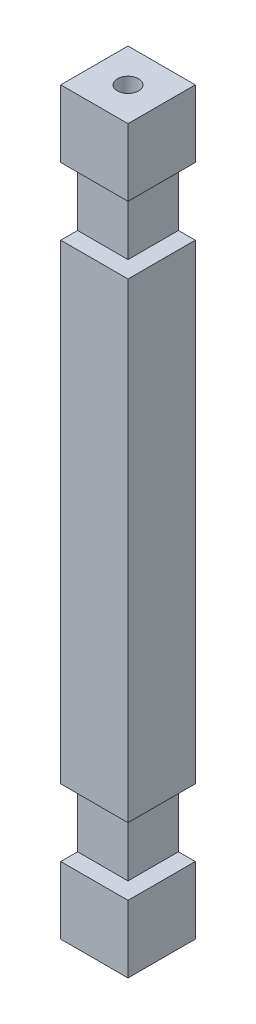
ISO-10303-21;
HEADER;
FILE_DESCRIPTION(('STEP AP214'),'2;1');
FILE_NAME('part.step','',(''),(''),'','','');
FILE_SCHEMA(('AUTOMOTIVE_DESIGN { 1 0 10303 214 1 1 1 1 }'));
ENDSEC;
DATA;
#1=APPLICATION_CONTEXT('core data for automotive mechanical design processes');
#2=APPLICATION_PROTOCOL_DEFINITION('international standard','automotive_design',2000,#1);
#3=PRODUCT_CONTEXT('',#1,'mechanical');
#4=PRODUCT('Part','Part','',(#3));
#5=PRODUCT_RELATED_PRODUCT_CATEGORY('part','',(#4));
#6=PRODUCT_DEFINITION_FORMATION('','',#4);
#7=PRODUCT_DEFINITION_CONTEXT('part definition',#1,'design');
#8=PRODUCT_DEFINITION('design','',#6,#7);
#9=PRODUCT_DEFINITION_SHAPE('','',#8);
#10=(LENGTH_UNIT() NAMED_UNIT(*) SI_UNIT(.MILLI.,.METRE.));
#11=(NAMED_UNIT(*) PLANE_ANGLE_UNIT() SI_UNIT($,.RADIAN.));
#12=(NAMED_UNIT(*) SI_UNIT($,.STERADIAN.) SOLID_ANGLE_UNIT());
#13=UNCERTAINTY_MEASURE_WITH_UNIT(LENGTH_MEASURE(1.E-05),#10,'distance_accuracy_value','');
#14=(GEOMETRIC_REPRESENTATION_CONTEXT(3) GLOBAL_UNCERTAINTY_ASSIGNED_CONTEXT((#13)) GLOBAL_UNIT_ASSIGNED_CONTEXT((#10,
#11,#12)) REPRESENTATION_CONTEXT('',''));
#15=CARTESIAN_POINT('',(0.,0.,0.));
#16=DIRECTION('',(0.,0.,1.));
#17=DIRECTION('',(1.,0.,0.));
#18=AXIS2_PLACEMENT_3D('',#15,#16,#17);
#19=CARTESIAN_POINT('',(25.4,279.4,50.8));
#20=DIRECTION('',(-1.,0.,0.));
#21=DIRECTION('',(0.,-1.,0.));
#22=AXIS2_PLACEMENT_3D('',#19,#20,#21);
#23=PLANE('',#22);
#24=DIRECTION('',(0.,0.,1.));
#25=VECTOR('',#24,1.);
#26=CARTESIAN_POINT('',(25.4000000000001,-177.8,38.1));
#27=LINE('',#26,#25);
#28=CARTESIAN_POINT('',(25.4000000000001,-177.8,0.));
#29=VERTEX_POINT('',#28);
#30=CARTESIAN_POINT('',(25.4,-177.8,50.8));
#31=VERTEX_POINT('',#30);
#32=EDGE_CURVE('E62',#29,#31,#27,.T.);
#33=ORIENTED_EDGE('',*,*,#32,.F.);
#34=DIRECTION('',(0.,1.,0.));
#35=VECTOR('',#34,1.);
#36=CARTESIAN_POINT('',(25.4,279.4,0.));
#37=LINE('',#36,#35);
#38=CARTESIAN_POINT('',(25.4,177.8,0.));
#39=VERTEX_POINT('',#38);
#40=EDGE_CURVE('E289',#29,#39,#37,.T.);
#41=ORIENTED_EDGE('',*,*,#40,.T.);
#42=DIRECTION('',(0.,0.,1.));
#43=VECTOR('',#42,1.);
#44=CARTESIAN_POINT('',(25.4000000000001,177.8,38.1));
#45=LINE('',#44,#43);
#46=CARTESIAN_POINT('',(25.4000000000001,177.8,50.8));
#47=VERTEX_POINT('',#46);
#48=EDGE_CURVE('E253',#39,#47,#45,.T.);
#49=ORIENTED_EDGE('',*,*,#48,.T.);
#50=DIRECTION('',(0.,1.,0.));
#51=VECTOR('',#50,1.);
#52=CARTESIAN_POINT('',(25.4,279.4,50.8));
#53=LINE('',#52,#51);
#54=EDGE_CURVE('E274',#31,#47,#53,.T.);
#55=ORIENTED_EDGE('',*,*,#54,.F.);
#56=EDGE_LOOP('',(#33,#41,#49,#55));
#57=FACE_BOUND('',#56,.T.);
#58=ADVANCED_FACE('F39',(#57),#23,.F.);
#59=CARTESIAN_POINT('',(0.,0.,38.1));
#60=DIRECTION('',(0.,0.,-1.));
#61=DIRECTION('',(-1.,0.,0.));
#62=AXIS2_PLACEMENT_3D('',#59,#60,#61);
#63=PLANE('',#62);
#64=DIRECTION('',(0.,-1.,0.));
#65=VECTOR('',#64,1.);
#66=CARTESIAN_POINT('',(12.7,0.,38.1));
#67=LINE('',#66,#65);
#68=CARTESIAN_POINT('',(12.7000000000001,-177.8,38.1));
#69=VERTEX_POINT('',#68);
#70=CARTESIAN_POINT('',(12.7000000000001,-228.6,38.1));
#71=VERTEX_POINT('',#70);
#72=EDGE_CURVE('E11',#69,#71,#67,.T.);
#73=ORIENTED_EDGE('',*,*,#72,.F.);
#74=DIRECTION('',(-1.,0.,0.));
#75=VECTOR('',#74,1.);
#76=CARTESIAN_POINT('',(25.4000000000001,-177.8,38.1));
#77=LINE('',#76,#75);
#78=CARTESIAN_POINT('',(-25.4,-177.8,38.1));
#79=VERTEX_POINT('',#78);
#80=EDGE_CURVE('E184',#69,#79,#77,.T.);
#81=ORIENTED_EDGE('',*,*,#80,.T.);
#82=DIRECTION('',(0.,-1.,0.));
#83=VECTOR('',#82,1.);
#84=CARTESIAN_POINT('',(-25.4,-177.8,38.1));
#85=LINE('',#84,#83);
#86=CARTESIAN_POINT('',(-25.4,-228.6,38.1));
#87=VERTEX_POINT('',#86);
#88=EDGE_CURVE('E187',#79,#87,#85,.T.);
#89=ORIENTED_EDGE('',*,*,#88,.T.);
#90=DIRECTION('',(1.,0.,0.));
#91=VECTOR('',#90,1.);
#92=CARTESIAN_POINT('',(25.4000000000001,-228.6,38.1));
#93=LINE('',#92,#91);
#94=EDGE_CURVE('E191',#87,#71,#93,.T.);
#95=ORIENTED_EDGE('',*,*,#94,.T.);
#96=EDGE_LOOP('',(#73,#81,#89,#95));
#97=FACE_BOUND('',#96,.T.);
#98=ADVANCED_FACE('F377',(#97),#63,.F.);
#99=CARTESIAN_POINT('',(0.,0.,50.8));
#100=DIRECTION('',(0.,0.,1.));
#101=DIRECTION('',(1.,0.,0.));
#102=AXIS2_PLACEMENT_3D('',#99,#100,#101);
#103=PLANE('',#102);
#104=DIRECTION('',(1.,0.,0.));
#105=VECTOR('',#104,1.);
#106=CARTESIAN_POINT('',(25.4000000000001,-228.6,50.8));
#107=LINE('',#106,#105);
#108=CARTESIAN_POINT('',(-25.4,-228.6,50.8));
#109=VERTEX_POINT('',#108);
#110=CARTESIAN_POINT('',(25.4000000000001,-228.6,50.8));
#111=VERTEX_POINT('',#110);
#112=EDGE_CURVE('E188',#109,#111,#107,.T.);
#113=ORIENTED_EDGE('',*,*,#112,.F.);
#114=DIRECTION('',(0.,-1.,0.));
#115=VECTOR('',#114,1.);
#116=CARTESIAN_POINT('',(-25.4,279.4,50.8));
#117=LINE('',#116,#115);
#118=CARTESIAN_POINT('',(-25.3999999999999,-279.4,50.8));
#119=VERTEX_POINT('',#118);
#120=EDGE_CURVE('E265',#109,#119,#117,.T.);
#121=ORIENTED_EDGE('',*,*,#120,.T.);
#122=DIRECTION('',(1.,0.,0.));
#123=VECTOR('',#122,1.);
#124=CARTESIAN_POINT('',(-25.3999999999999,-279.4,50.8));
#125=LINE('',#124,#123);
#126=CARTESIAN_POINT('',(25.4000000000001,-279.4,50.8));
#127=VERTEX_POINT('',#126);
#128=EDGE_CURVE('E263',#119,#127,#125,.T.);
#129=ORIENTED_EDGE('',*,*,#128,.T.);
#130=EDGE_CURVE('E269',#127,#111,#53,.T.);
#131=ORIENTED_EDGE('',*,*,#130,.T.);
#132=EDGE_LOOP('',(#113,#121,#129,#131));
#133=FACE_BOUND('',#132,.T.);
#134=ADVANCED_FACE('F383',(#133),#103,.T.);
#135=DIRECTION('',(0.,0.,1.));
#136=VECTOR('',#135,1.);
#137=CARTESIAN_POINT('',(25.4000000000001,228.6,38.1));
#138=LINE('',#137,#136);
#139=CARTESIAN_POINT('',(25.4,228.6,0.));
#140=VERTEX_POINT('',#139);
#141=CARTESIAN_POINT('',(25.4000000000001,228.6,50.8));
#142=VERTEX_POINT('',#141);
#143=EDGE_CURVE('E250',#140,#142,#138,.T.);
#144=ORIENTED_EDGE('',*,*,#143,.F.);
#145=CARTESIAN_POINT('',(25.4,279.4,0.));
#146=VERTEX_POINT('',#145);
#147=EDGE_CURVE('E284',#140,#146,#37,.T.);
#148=ORIENTED_EDGE('',*,*,#147,.T.);
#149=DIRECTION('',(0.,0.,-1.));
#150=VECTOR('',#149,1.);
#151=CARTESIAN_POINT('',(25.4,279.4,50.8));
#152=LINE('',#151,#150);
#153=CARTESIAN_POINT('',(25.4,279.4,50.8));
#154=VERTEX_POINT('',#153);
#155=EDGE_CURVE('E295',#154,#146,#152,.T.);
#156=ORIENTED_EDGE('',*,*,#155,.F.);
#157=EDGE_CURVE('E268',#142,#154,#53,.T.);
#158=ORIENTED_EDGE('',*,*,#157,.F.);
#159=EDGE_LOOP('',(#144,#148,#156,#158));
#160=FACE_BOUND('',#159,.T.);
#161=ADVANCED_FACE('F343',(#160),#23,.F.);
#162=CARTESIAN_POINT('',(0.,0.,38.1));
#163=DIRECTION('',(0.,0.,1.));
#164=DIRECTION('',(1.,0.,0.));
#165=AXIS2_PLACEMENT_3D('',#162,#163,#164);
#166=PLANE('',#165);
#167=DIRECTION('',(1.,0.,0.));
#168=VECTOR('',#167,1.);
#169=CARTESIAN_POINT('',(-25.4,177.8,38.1));
#170=LINE('',#169,#168);
#171=CARTESIAN_POINT('',(-25.4,177.8,38.1));
#172=VERTEX_POINT('',#171);
#173=CARTESIAN_POINT('',(12.7,177.8,38.1));
#174=VERTEX_POINT('',#173);
#175=EDGE_CURVE('E231',#172,#174,#170,.T.);
#176=ORIENTED_EDGE('',*,*,#175,.T.);
#177=DIRECTION('',(0.,1.,0.));
#178=VECTOR('',#177,1.);
#179=CARTESIAN_POINT('',(12.7,0.,38.1));
#180=LINE('',#179,#178);
#181=CARTESIAN_POINT('',(12.7,228.6,38.1));
#182=VERTEX_POINT('',#181);
#183=EDGE_CURVE('E48',#174,#182,#180,.T.);
#184=ORIENTED_EDGE('',*,*,#183,.T.);
#185=DIRECTION('',(-1.,0.,0.));
#186=VECTOR('',#185,1.);
#187=CARTESIAN_POINT('',(-25.4,228.6,38.1));
#188=LINE('',#187,#186);
#189=CARTESIAN_POINT('',(-25.4,228.6,38.1));
#190=VERTEX_POINT('',#189);
#191=EDGE_CURVE('E236',#182,#190,#188,.T.);
#192=ORIENTED_EDGE('',*,*,#191,.T.);
#193=DIRECTION('',(0.,-1.,0.));
#194=VECTOR('',#193,1.);
#195=CARTESIAN_POINT('',(-25.4,228.6,38.1));
#196=LINE('',#195,#194);
#197=EDGE_CURVE('E227',#190,#172,#196,.T.);
#198=ORIENTED_EDGE('',*,*,#197,.T.);
#199=EDGE_LOOP('',(#176,#184,#192,#198));
#200=FACE_BOUND('',#199,.T.);
#201=ADVANCED_FACE('F310',(#200),#166,.T.);
#202=DIRECTION('',(-1.,0.,0.));
#203=VECTOR('',#202,1.);
#204=CARTESIAN_POINT('',(-25.4,228.6,50.8));
#205=LINE('',#204,#203);
#206=CARTESIAN_POINT('',(-25.4,228.6,50.8));
#207=VERTEX_POINT('',#206);
#208=EDGE_CURVE('E232',#142,#207,#205,.T.);
#209=ORIENTED_EDGE('',*,*,#208,.F.);
#210=ORIENTED_EDGE('',*,*,#157,.T.);
#211=DIRECTION('',(-1.,0.,0.));
#212=VECTOR('',#211,1.);
#213=CARTESIAN_POINT('',(-25.4,279.4,50.8));
#214=LINE('',#213,#212);
#215=CARTESIAN_POINT('',(-25.4,279.4,50.8));
#216=VERTEX_POINT('',#215);
#217=EDGE_CURVE('E273',#154,#216,#214,.T.);
#218=ORIENTED_EDGE('',*,*,#217,.T.);
#219=EDGE_CURVE('E259',#216,#207,#117,.T.);
#220=ORIENTED_EDGE('',*,*,#219,.T.);
#221=EDGE_LOOP('',(#209,#210,#218,#220));
#222=FACE_BOUND('',#221,.T.);
#223=ADVANCED_FACE('F339',(#222),#103,.T.);
#224=CARTESIAN_POINT('',(-25.4,279.4,50.8));
#225=DIRECTION('',(1.,0.,0.));
#226=DIRECTION('',(0.,1.,0.));
#227=AXIS2_PLACEMENT_3D('',#224,#225,#226);
#228=PLANE('',#227);
#229=ORIENTED_EDGE('',*,*,#120,.F.);
#230=DIRECTION('',(0.,0.,1.));
#231=VECTOR('',#230,1.);
#232=CARTESIAN_POINT('',(-25.4,-228.6,38.1));
#233=LINE('',#232,#231);
#234=EDGE_CURVE('E201',#87,#109,#233,.T.);
#235=ORIENTED_EDGE('',*,*,#234,.F.);
#236=ORIENTED_EDGE('',*,*,#88,.F.);
#237=DIRECTION('',(0.,0.,1.));
#238=VECTOR('',#237,1.);
#239=CARTESIAN_POINT('',(-25.4,-177.8,38.1));
#240=LINE('',#239,#238);
#241=CARTESIAN_POINT('',(-25.4,-177.8,50.8));
#242=VERTEX_POINT('',#241);
#243=EDGE_CURVE('E204',#79,#242,#240,.T.);
#244=ORIENTED_EDGE('',*,*,#243,.T.);
#245=CARTESIAN_POINT('',(-25.4,177.8,50.8));
#246=VERTEX_POINT('',#245);
#247=EDGE_CURVE('E264',#246,#242,#117,.T.);
#248=ORIENTED_EDGE('',*,*,#247,.F.);
#249=DIRECTION('',(0.,0.,1.));
#250=VECTOR('',#249,1.);
#251=CARTESIAN_POINT('',(-25.4,177.8,38.1));
#252=LINE('',#251,#250);
#253=EDGE_CURVE('E239',#172,#246,#252,.T.);
#254=ORIENTED_EDGE('',*,*,#253,.F.);
#255=ORIENTED_EDGE('',*,*,#197,.F.);
#256=DIRECTION('',(0.,0.,1.));
#257=VECTOR('',#256,1.);
#258=CARTESIAN_POINT('',(-25.4,228.6,38.1));
#259=LINE('',#258,#257);
#260=EDGE_CURVE('E245',#190,#207,#259,.T.);
#261=ORIENTED_EDGE('',*,*,#260,.T.);
#262=ORIENTED_EDGE('',*,*,#219,.F.);
#263=DIRECTION('',(0.,0.,-1.));
#264=VECTOR('',#263,1.);
#265=CARTESIAN_POINT('',(-25.4,279.4,50.8));
#266=LINE('',#265,#264);
#267=CARTESIAN_POINT('',(-25.4,279.4,0.));
#268=VERTEX_POINT('',#267);
#269=EDGE_CURVE('E277',#216,#268,#266,.T.);
#270=ORIENTED_EDGE('',*,*,#269,.T.);
#271=DIRECTION('',(0.,-1.,0.));
#272=VECTOR('',#271,1.);
#273=CARTESIAN_POINT('',(-25.4,279.4,0.));
#274=LINE('',#273,#272);
#275=CARTESIAN_POINT('',(-25.3999999999999,-279.4,0.));
#276=VERTEX_POINT('',#275);
#277=EDGE_CURVE('E249',#268,#276,#274,.T.);
#278=ORIENTED_EDGE('',*,*,#277,.T.);
#279=DIRECTION('',(0.,0.,-1.));
#280=VECTOR('',#279,1.);
#281=CARTESIAN_POINT('',(-25.3999999999999,-279.4,50.8));
#282=LINE('',#281,#280);
#283=EDGE_CURVE('E303',#119,#276,#282,.T.);
#284=ORIENTED_EDGE('',*,*,#283,.F.);
#285=EDGE_LOOP('',(#229,#235,#236,#244,#248,#254,#255,#261,#262,#270,#278,#284));
#286=FACE_BOUND('',#285,.T.);
#287=ADVANCED_FACE('F41',(#286),#228,.F.);
#288=CARTESIAN_POINT('',(-25.3999999999999,-279.4,50.8));
#289=DIRECTION('',(0.,1.,0.));
#290=DIRECTION('',(0.,0.,1.));
#291=AXIS2_PLACEMENT_3D('',#288,#289,#290);
#292=PLANE('',#291);
#293=CARTESIAN_POINT('',(0.,-279.4,25.4));
#294=DIRECTION('',(0.,-1.,0.));
#295=DIRECTION('',(0.,0.,-1.));
#296=AXIS2_PLACEMENT_3D('',#293,#294,#295);
#297=CIRCLE('',#296,8.00000000000001);
#298=CARTESIAN_POINT('',(0.,-279.4,17.4));
#299=VERTEX_POINT('',#298);
#300=EDGE_CURVE('E426',#299,#299,#297,.T.);
#301=ORIENTED_EDGE('',*,*,#300,.F.);
#302=EDGE_LOOP('',(#301));
#303=FACE_BOUND('',#302,.T.);
#304=DIRECTION('',(1.,0.,0.));
#305=VECTOR('',#304,1.);
#306=CARTESIAN_POINT('',(-25.3999999999999,-279.4,0.));
#307=LINE('',#306,#305);
#308=CARTESIAN_POINT('',(25.4000000000001,-279.4,0.));
#309=VERTEX_POINT('',#308);
#310=EDGE_CURVE('E281',#276,#309,#307,.T.);
#311=ORIENTED_EDGE('',*,*,#310,.T.);
#312=DIRECTION('',(0.,0.,-1.));
#313=VECTOR('',#312,1.);
#314=CARTESIAN_POINT('',(25.4000000000001,-279.4,50.8));
#315=LINE('',#314,#313);
#316=EDGE_CURVE('E299',#127,#309,#315,.T.);
#317=ORIENTED_EDGE('',*,*,#316,.F.);
#318=ORIENTED_EDGE('',*,*,#128,.F.);
#319=ORIENTED_EDGE('',*,*,#283,.T.);
#320=EDGE_LOOP('',(#311,#317,#318,#319));
#321=FACE_BOUND('',#320,.T.);
#322=ADVANCED_FACE('F353',(#303,#321),#292,.F.);
#323=CARTESIAN_POINT('',(25.4000000000001,-228.6,0.));
#324=VERTEX_POINT('',#323);
#325=EDGE_CURVE('E285',#309,#324,#37,.T.);
#326=ORIENTED_EDGE('',*,*,#325,.T.);
#327=DIRECTION('',(0.,0.,1.));
#328=VECTOR('',#327,1.);
#329=CARTESIAN_POINT('',(25.4000000000001,-228.6,38.1));
#330=LINE('',#329,#328);
#331=EDGE_CURVE('E165',#324,#111,#330,.T.);
#332=ORIENTED_EDGE('',*,*,#331,.T.);
#333=ORIENTED_EDGE('',*,*,#130,.F.);
#334=ORIENTED_EDGE('',*,*,#316,.T.);
#335=EDGE_LOOP('',(#326,#332,#333,#334));
#336=FACE_BOUND('',#335,.T.);
#337=ADVANCED_FACE('F379',(#336),#23,.F.);
#338=CARTESIAN_POINT('',(-25.4,279.4,50.8));
#339=DIRECTION('',(0.,-1.,0.));
#340=DIRECTION('',(0.,0.,-1.));
#341=AXIS2_PLACEMENT_3D('',#338,#339,#340);
#342=PLANE('',#341);
#343=CARTESIAN_POINT('',(0.,279.4,25.4));
#344=DIRECTION('',(0.,1.,0.));
#345=DIRECTION('',(0.,0.,1.));
#346=AXIS2_PLACEMENT_3D('',#343,#344,#345);
#347=CIRCLE('',#346,8.00000000000001);
#348=CARTESIAN_POINT('',(0.,279.4,33.4));
#349=VERTEX_POINT('',#348);
#350=EDGE_CURVE('E427',#349,#349,#347,.T.);
#351=ORIENTED_EDGE('',*,*,#350,.F.);
#352=EDGE_LOOP('',(#351));
#353=FACE_BOUND('',#352,.T.);
#354=DIRECTION('',(-1.,0.,0.));
#355=VECTOR('',#354,1.);
#356=CARTESIAN_POINT('',(-25.4,279.4,0.));
#357=LINE('',#356,#355);
#358=EDGE_CURVE('E288',#146,#268,#357,.T.);
#359=ORIENTED_EDGE('',*,*,#358,.T.);
#360=ORIENTED_EDGE('',*,*,#269,.F.);
#361=ORIENTED_EDGE('',*,*,#217,.F.);
#362=ORIENTED_EDGE('',*,*,#155,.T.);
#363=EDGE_LOOP('',(#359,#360,#361,#362));
#364=FACE_BOUND('',#363,.T.);
#365=ADVANCED_FACE('F347',(#353,#364),#342,.F.);
#366=DIRECTION('',(-1.,0.,0.));
#367=VECTOR('',#366,1.);
#368=CARTESIAN_POINT('',(25.4000000000001,-177.8,50.8));
#369=LINE('',#368,#367);
#370=EDGE_CURVE('E182',#31,#242,#369,.T.);
#371=ORIENTED_EDGE('',*,*,#370,.F.);
#372=ORIENTED_EDGE('',*,*,#54,.T.);
#373=DIRECTION('',(1.,0.,0.));
#374=VECTOR('',#373,1.);
#375=CARTESIAN_POINT('',(-25.4,177.8,50.8));
#376=LINE('',#375,#374);
#377=EDGE_CURVE('E223',#246,#47,#376,.T.);
#378=ORIENTED_EDGE('',*,*,#377,.F.);
#379=ORIENTED_EDGE('',*,*,#247,.T.);
#380=EDGE_LOOP('',(#371,#372,#378,#379));
#381=FACE_BOUND('',#380,.T.);
#382=ADVANCED_FACE('F331',(#381),#103,.T.);
#383=CARTESIAN_POINT('',(0.,0.,0.));
#384=DIRECTION('',(0.,0.,1.));
#385=DIRECTION('',(1.,0.,0.));
#386=AXIS2_PLACEMENT_3D('',#383,#384,#385);
#387=PLANE('',#386);
#388=ORIENTED_EDGE('',*,*,#40,.F.);
#389=DIRECTION('',(1.,0.,0.));
#390=VECTOR('',#389,1.);
#391=CARTESIAN_POINT('',(12.7000000000001,-177.8,0.));
#392=LINE('',#391,#390);
#393=CARTESIAN_POINT('',(12.7000000000001,-177.8,0.));
#394=VERTEX_POINT('',#393);
#395=EDGE_CURVE('E170',#394,#29,#392,.T.);
#396=ORIENTED_EDGE('',*,*,#395,.F.);
#397=DIRECTION('',(0.,1.,0.));
#398=VECTOR('',#397,1.);
#399=CARTESIAN_POINT('',(12.7000000000001,-177.8,0.));
#400=LINE('',#399,#398);
#401=CARTESIAN_POINT('',(12.7000000000001,-228.6,0.));
#402=VERTEX_POINT('',#401);
#403=EDGE_CURVE('E154',#402,#394,#400,.T.);
#404=ORIENTED_EDGE('',*,*,#403,.F.);
#405=DIRECTION('',(1.,0.,0.));
#406=VECTOR('',#405,1.);
#407=CARTESIAN_POINT('',(12.7000000000001,-228.6,0.));
#408=LINE('',#407,#406);
#409=EDGE_CURVE('E162',#402,#324,#408,.T.);
#410=ORIENTED_EDGE('',*,*,#409,.T.);
#411=ORIENTED_EDGE('',*,*,#325,.F.);
#412=ORIENTED_EDGE('',*,*,#310,.F.);
#413=ORIENTED_EDGE('',*,*,#277,.F.);
#414=ORIENTED_EDGE('',*,*,#358,.F.);
#415=ORIENTED_EDGE('',*,*,#147,.F.);
#416=DIRECTION('',(1.,0.,0.));
#417=VECTOR('',#416,1.);
#418=CARTESIAN_POINT('',(12.7,228.6,0.));
#419=LINE('',#418,#417);
#420=CARTESIAN_POINT('',(12.7,228.6,0.));
#421=VERTEX_POINT('',#420);
#422=EDGE_CURVE('E219',#421,#140,#419,.T.);
#423=ORIENTED_EDGE('',*,*,#422,.F.);
#424=DIRECTION('',(0.,1.,0.));
#425=VECTOR('',#424,1.);
#426=CARTESIAN_POINT('',(12.7,228.6,0.));
#427=LINE('',#426,#425);
#428=CARTESIAN_POINT('',(12.7,177.8,0.));
#429=VERTEX_POINT('',#428);
#430=EDGE_CURVE('E212',#429,#421,#427,.T.);
#431=ORIENTED_EDGE('',*,*,#430,.F.);
#432=DIRECTION('',(1.,0.,0.));
#433=VECTOR('',#432,1.);
#434=CARTESIAN_POINT('',(12.7,177.8,0.));
#435=LINE('',#434,#433);
#436=EDGE_CURVE('E218',#429,#39,#435,.T.);
#437=ORIENTED_EDGE('',*,*,#436,.T.);
#438=EDGE_LOOP('',(#388,#396,#404,#410,#411,#412,#413,#414,#415,#423,#431,#437));
#439=FACE_BOUND('',#438,.T.);
#440=ADVANCED_FACE('F174',(#439),#387,.F.);
#441=CARTESIAN_POINT('',(-25.4,228.6,38.1));
#442=DIRECTION('',(0.,1.,0.));
#443=DIRECTION('',(0.,0.,1.));
#444=AXIS2_PLACEMENT_3D('',#441,#442,#443);
#445=PLANE('',#444);
#446=ORIENTED_EDGE('',*,*,#208,.T.);
#447=ORIENTED_EDGE('',*,*,#260,.F.);
#448=ORIENTED_EDGE('',*,*,#191,.F.);
#449=DIRECTION('',(0.,0.,1.));
#450=VECTOR('',#449,1.);
#451=CARTESIAN_POINT('',(12.7,228.6,50.8));
#452=LINE('',#451,#450);
#453=EDGE_CURVE('E215',#421,#182,#452,.T.);
#454=ORIENTED_EDGE('',*,*,#453,.F.);
#455=ORIENTED_EDGE('',*,*,#422,.T.);
#456=ORIENTED_EDGE('',*,*,#143,.T.);
#457=EDGE_LOOP('',(#446,#447,#448,#454,#455,#456));
#458=FACE_BOUND('',#457,.T.);
#459=ADVANCED_FACE('F316',(#458),#445,.F.);
#460=CARTESIAN_POINT('',(-25.4,177.8,38.1));
#461=DIRECTION('',(0.,-1.,0.));
#462=DIRECTION('',(0.,0.,-1.));
#463=AXIS2_PLACEMENT_3D('',#460,#461,#462);
#464=PLANE('',#463);
#465=ORIENTED_EDGE('',*,*,#48,.F.);
#466=ORIENTED_EDGE('',*,*,#436,.F.);
#467=DIRECTION('',(0.,0.,-1.));
#468=VECTOR('',#467,1.);
#469=CARTESIAN_POINT('',(12.7,177.8,50.8));
#470=LINE('',#469,#468);
#471=EDGE_CURVE('E200',#174,#429,#470,.T.);
#472=ORIENTED_EDGE('',*,*,#471,.F.);
#473=ORIENTED_EDGE('',*,*,#175,.F.);
#474=ORIENTED_EDGE('',*,*,#253,.T.);
#475=ORIENTED_EDGE('',*,*,#377,.T.);
#476=EDGE_LOOP('',(#465,#466,#472,#473,#474,#475));
#477=FACE_BOUND('',#476,.T.);
#478=ADVANCED_FACE('F329',(#477),#464,.F.);
#479=CARTESIAN_POINT('',(12.7,0.,0.));
#480=DIRECTION('',(1.,0.,0.));
#481=DIRECTION('',(0.,1.,0.));
#482=AXIS2_PLACEMENT_3D('',#479,#480,#481);
#483=PLANE('',#482);
#484=ORIENTED_EDGE('',*,*,#471,.T.);
#485=ORIENTED_EDGE('',*,*,#430,.T.);
#486=ORIENTED_EDGE('',*,*,#453,.T.);
#487=ORIENTED_EDGE('',*,*,#183,.F.);
#488=EDGE_LOOP('',(#484,#485,#486,#487));
#489=FACE_BOUND('',#488,.T.);
#490=ADVANCED_FACE('F364',(#489),#483,.T.);
#491=CARTESIAN_POINT('',(25.4000000000001,-228.6,38.1));
#492=DIRECTION('',(0.,-1.,0.));
#493=DIRECTION('',(0.,0.,-1.));
#494=AXIS2_PLACEMENT_3D('',#491,#492,#493);
#495=PLANE('',#494);
#496=ORIENTED_EDGE('',*,*,#331,.F.);
#497=ORIENTED_EDGE('',*,*,#409,.F.);
#498=DIRECTION('',(0.,0.,-1.));
#499=VECTOR('',#498,1.);
#500=CARTESIAN_POINT('',(12.7000000000001,-228.6,50.8));
#501=LINE('',#500,#499);
#502=EDGE_CURVE('E150',#71,#402,#501,.T.);
#503=ORIENTED_EDGE('',*,*,#502,.F.);
#504=ORIENTED_EDGE('',*,*,#94,.F.);
#505=ORIENTED_EDGE('',*,*,#234,.T.);
#506=ORIENTED_EDGE('',*,*,#112,.T.);
#507=EDGE_LOOP('',(#496,#497,#503,#504,#505,#506));
#508=FACE_BOUND('',#507,.T.);
#509=ADVANCED_FACE('F163',(#508),#495,.F.);
#510=CARTESIAN_POINT('',(25.4000000000001,-177.8,38.1));
#511=DIRECTION('',(0.,1.,0.));
#512=DIRECTION('',(0.,0.,1.));
#513=AXIS2_PLACEMENT_3D('',#510,#511,#512);
#514=PLANE('',#513);
#515=ORIENTED_EDGE('',*,*,#370,.T.);
#516=ORIENTED_EDGE('',*,*,#243,.F.);
#517=ORIENTED_EDGE('',*,*,#80,.F.);
#518=DIRECTION('',(0.,0.,1.));
#519=VECTOR('',#518,1.);
#520=CARTESIAN_POINT('',(12.7000000000001,-177.8,50.8));
#521=LINE('',#520,#519);
#522=EDGE_CURVE('E54',#394,#69,#521,.T.);
#523=ORIENTED_EDGE('',*,*,#522,.F.);
#524=ORIENTED_EDGE('',*,*,#395,.T.);
#525=ORIENTED_EDGE('',*,*,#32,.T.);
#526=EDGE_LOOP('',(#515,#516,#517,#523,#524,#525));
#527=FACE_BOUND('',#526,.T.);
#528=ADVANCED_FACE('F371',(#527),#514,.F.);
#529=CARTESIAN_POINT('',(12.7,0.,0.));
#530=DIRECTION('',(1.,0.,0.));
#531=DIRECTION('',(0.,1.,0.));
#532=AXIS2_PLACEMENT_3D('',#529,#530,#531);
#533=PLANE('',#532);
#534=ORIENTED_EDGE('',*,*,#72,.T.);
#535=ORIENTED_EDGE('',*,*,#502,.T.);
#536=ORIENTED_EDGE('',*,*,#403,.T.);
#537=ORIENTED_EDGE('',*,*,#522,.T.);
#538=EDGE_LOOP('',(#534,#535,#536,#537));
#539=FACE_BOUND('',#538,.T.);
#540=ADVANCED_FACE('F152',(#539),#533,.T.);
#541=CARTESIAN_POINT('',(0.,-263.4,25.4));
#542=DIRECTION('',(0.,-1.,0.));
#543=DIRECTION('',(0.,0.,-1.));
#544=AXIS2_PLACEMENT_3D('',#541,#542,#543);
#545=CYLINDRICAL_SURFACE('',#544,8.00000000000001);
#546=CARTESIAN_POINT('',(0.,-263.4,25.4));
#547=DIRECTION('',(0.,-1.,0.));
#548=DIRECTION('',(0.,0.,-1.));
#549=AXIS2_PLACEMENT_3D('',#546,#547,#548);
#550=CIRCLE('',#549,8.00000000000001);
#551=CARTESIAN_POINT('',(0.,-263.4,17.4));
#552=VERTEX_POINT('',#551);
#553=EDGE_CURVE('E159',#552,#552,#550,.T.);
#554=ORIENTED_EDGE('',*,*,#553,.F.);
#555=EDGE_LOOP('',(#554));
#556=FACE_BOUND('',#555,.T.);
#557=ORIENTED_EDGE('',*,*,#300,.T.);
#558=EDGE_LOOP('',(#557));
#559=FACE_BOUND('',#558,.T.);
#560=ADVANCED_FACE('F403',(#556,#559),#545,.F.);
#561=CARTESIAN_POINT('',(0.,-263.4,25.4));
#562=DIRECTION('',(0.,-1.,0.));
#563=DIRECTION('',(0.,0.,-1.));
#564=AXIS2_PLACEMENT_3D('',#561,#562,#563);
#565=PLANE('',#564);
#566=ORIENTED_EDGE('',*,*,#553,.T.);
#567=EDGE_LOOP('',(#566));
#568=FACE_BOUND('',#567,.T.);
#569=ADVANCED_FACE('F408',(#568),#565,.T.);
#570=CARTESIAN_POINT('',(0.,263.4,25.4));
#571=DIRECTION('',(0.,1.,0.));
#572=DIRECTION('',(0.,0.,1.));
#573=AXIS2_PLACEMENT_3D('',#570,#571,#572);
#574=CYLINDRICAL_SURFACE('',#573,8.00000000000001);
#575=CARTESIAN_POINT('',(0.,263.4,25.4));
#576=DIRECTION('',(0.,1.,0.));
#577=DIRECTION('',(0.,0.,1.));
#578=AXIS2_PLACEMENT_3D('',#575,#576,#577);
#579=CIRCLE('',#578,8.00000000000001);
#580=CARTESIAN_POINT('',(0.,263.4,33.4));
#581=VERTEX_POINT('',#580);
#582=EDGE_CURVE('E424',#581,#581,#579,.T.);
#583=ORIENTED_EDGE('',*,*,#582,.F.);
#584=EDGE_LOOP('',(#583));
#585=FACE_BOUND('',#584,.T.);
#586=ORIENTED_EDGE('',*,*,#350,.T.);
#587=EDGE_LOOP('',(#586));
#588=FACE_BOUND('',#587,.T.);
#589=ADVANCED_FACE('F412',(#585,#588),#574,.F.);
#590=CARTESIAN_POINT('',(0.,263.4,25.4));
#591=DIRECTION('',(0.,1.,0.));
#592=DIRECTION('',(0.,0.,1.));
#593=AXIS2_PLACEMENT_3D('',#590,#591,#592);
#594=PLANE('',#593);
#595=ORIENTED_EDGE('',*,*,#582,.T.);
#596=EDGE_LOOP('',(#595));
#597=FACE_BOUND('',#596,.T.);
#598=ADVANCED_FACE('F416',(#597),#594,.T.);
#599=CLOSED_SHELL('',(#58,#98,#134,#161,#201,#223,#287,#322,#337,#365,#382,#440,#459,#478,#490,
#509,#528,#540,#560,#569,#589,#598));
#600=MANIFOLD_SOLID_BREP('B2',#599);
#601=ADVANCED_BREP_SHAPE_REPRESENTATION('',(#18,#600),#14);
#602=SHAPE_DEFINITION_REPRESENTATION(#9,#601);
ENDSEC;
END-ISO-10303-21;
